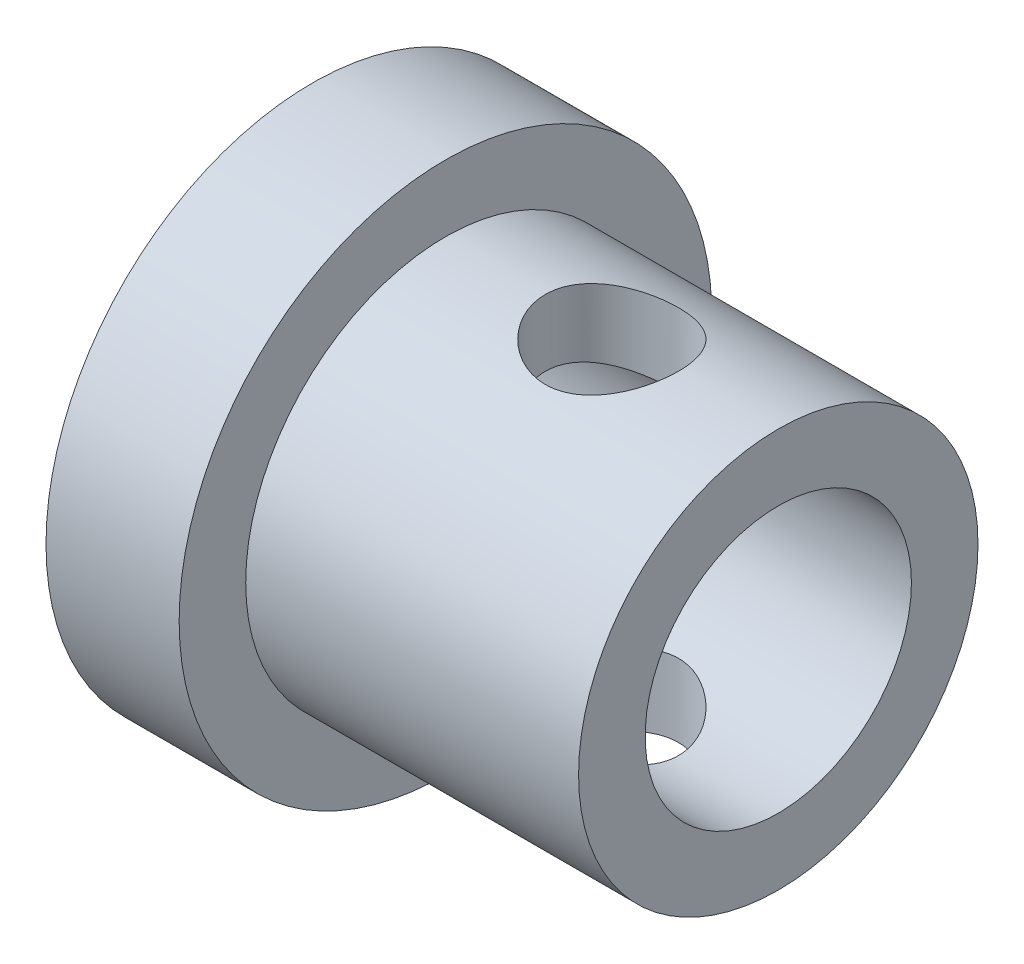
ISO-10303-21;
HEADER;
FILE_DESCRIPTION(('STEP AP214'),'2;1');
FILE_NAME('part.step','',(''),(''),'','','');
FILE_SCHEMA(('AUTOMOTIVE_DESIGN { 1 0 10303 214 1 1 1 1 }'));
ENDSEC;
DATA;
#1=APPLICATION_CONTEXT('core data for automotive mechanical design processes');
#2=APPLICATION_PROTOCOL_DEFINITION('international standard','automotive_design',2000,#1);
#3=PRODUCT_CONTEXT('',#1,'mechanical');
#4=PRODUCT('Part','Part','',(#3));
#5=PRODUCT_RELATED_PRODUCT_CATEGORY('part','',(#4));
#6=PRODUCT_DEFINITION_FORMATION('','',#4);
#7=PRODUCT_DEFINITION_CONTEXT('part definition',#1,'design');
#8=PRODUCT_DEFINITION('design','',#6,#7);
#9=PRODUCT_DEFINITION_SHAPE('','',#8);
#10=(LENGTH_UNIT() NAMED_UNIT(*) SI_UNIT(.MILLI.,.METRE.));
#11=(NAMED_UNIT(*) PLANE_ANGLE_UNIT() SI_UNIT($,.RADIAN.));
#12=(NAMED_UNIT(*) SI_UNIT($,.STERADIAN.) SOLID_ANGLE_UNIT());
#13=UNCERTAINTY_MEASURE_WITH_UNIT(LENGTH_MEASURE(1.E-05),#10,'distance_accuracy_value','');
#14=(GEOMETRIC_REPRESENTATION_CONTEXT(3) GLOBAL_UNCERTAINTY_ASSIGNED_CONTEXT((#13)) GLOBAL_UNIT_ASSIGNED_CONTEXT((#10,
#11,#12)) REPRESENTATION_CONTEXT('',''));
#15=CARTESIAN_POINT('',(0.,0.,0.));
#16=DIRECTION('',(0.,0.,1.));
#17=DIRECTION('',(1.,0.,0.));
#18=AXIS2_PLACEMENT_3D('',#15,#16,#17);
#19=CARTESIAN_POINT('',(3.5,0.,0.));
#20=DIRECTION('',(-1.,0.,0.));
#21=DIRECTION('',(0.,0.,1.));
#22=AXIS2_PLACEMENT_3D('',#19,#20,#21);
#23=CYLINDRICAL_SURFACE('',#22,3.);
#24=CARTESIAN_POINT('',(1.,-2.82842712474619,1.));
#25=CARTESIAN_POINT('',(1.05446817481068,-2.82842694532735,1.0000002579478));
#26=CARTESIAN_POINT('',(1.10893479977153,-2.83001769372806,0.99553478369814));
#27=CARTESIAN_POINT('',(1.21625442095062,-2.8361757417458,0.977851131702564));
#28=CARTESIAN_POINT('',(1.26910714986394,-2.8407435316722,0.964631512170673));
#29=CARTESIAN_POINT('',(1.37162689301281,-2.85228203663888,0.929955485680262));
#30=CARTESIAN_POINT('',(1.42129992944688,-2.8592480396464,0.908515221402));
#31=CARTESIAN_POINT('',(1.5163600485438,-2.87479122017008,0.858061628442627));
#32=CARTESIAN_POINT('',(1.5617461825525,-2.88336875305432,0.829046628860522));
#33=CARTESIAN_POINT('',(1.64871996233949,-2.90154489405589,0.763051146442527));
#34=CARTESIAN_POINT('',(1.69011542867204,-2.91116894844139,0.725824341377825));
#35=CARTESIAN_POINT('',(1.76620680122432,-2.93013864801508,0.644987667214489));
#36=CARTESIAN_POINT('',(1.80090163158228,-2.93948424829099,0.601376775052401));
#37=CARTESIAN_POINT('',(1.86347889732968,-2.95713866921658,0.507604507964983));
#38=CARTESIAN_POINT('',(1.89115997061798,-2.96541407701568,0.457301911224518));
#39=CARTESIAN_POINT('',(1.93759158512749,-2.97969586771021,0.352431222987481));
#40=CARTESIAN_POINT('',(1.9563445331769,-2.98570286203012,0.297864285687214));
#41=CARTESIAN_POINT('',(1.9837358546324,-2.99459075431897,0.188028817433492));
#42=CARTESIAN_POINT('',(1.99270344625701,-2.99757314777558,0.132850754852967));
#43=CARTESIAN_POINT('',(2.00131629336066,-3.00043608218249,0.0216978748240906));
#44=CARTESIAN_POINT('',(2.00096395165242,-3.00031742262891,-0.0342767335438934));
#45=CARTESIAN_POINT('',(1.99115574543397,-2.99706039618736,-0.143103515193818));
#46=CARTESIAN_POINT('',(1.98205747152549,-2.99404064755135,-0.195992048591668));
#47=CARTESIAN_POINT('',(1.95560701901955,-2.98546967339714,-0.299443438822161));
#48=CARTESIAN_POINT('',(1.93825428102024,-2.97991827631115,-0.350006137779176));
#49=CARTESIAN_POINT('',(1.89557868269387,-2.96675670293292,-0.448152474842014));
#50=CARTESIAN_POINT('',(1.87015406145322,-2.9591204252427,-0.495688220968999));
#51=CARTESIAN_POINT('',(1.81214029455161,-2.94258393038665,-0.58592432552717));
#52=CARTESIAN_POINT('',(1.77954915667336,-2.93368336200518,-0.62862333438477));
#53=CARTESIAN_POINT('',(1.70632560653926,-2.9150619185089,-0.710100866551907));
#54=CARTESIAN_POINT('',(1.66538684215456,-2.90532215172667,-0.748600157067556));
#55=CARTESIAN_POINT('',(1.57755127427734,-2.88647335245111,-0.81827725959589));
#56=CARTESIAN_POINT('',(1.53065355428676,-2.8773644173145,-0.849453943273005));
#57=CARTESIAN_POINT('',(1.43134637438458,-2.86070525135531,-0.903987455042732));
#58=CARTESIAN_POINT('',(1.37886786863219,-2.85317909338821,-0.927226463651049));
#59=CARTESIAN_POINT('',(1.27042860573374,-2.84081650878299,-0.964443193299507));
#60=CARTESIAN_POINT('',(1.21446931877818,-2.83597895501223,-0.978424795755529));
#61=CARTESIAN_POINT('',(1.10336164459938,-2.8297963630207,-0.996161282090474));
#62=CARTESIAN_POINT('',(1.04829057525428,-2.82830360315139,-1.00034909550575));
#63=CARTESIAN_POINT('',(0.938223850882962,-2.828566720628,-0.999605438911605));
#64=CARTESIAN_POINT('',(0.883228183975239,-2.83032200792768,-0.99467562522726));
#65=CARTESIAN_POINT('',(0.776843034288837,-2.83673618089379,-0.97622565155183));
#66=CARTESIAN_POINT('',(0.725394569849359,-2.84129325440593,-0.963006393980555));
#67=CARTESIAN_POINT('',(0.625456393760615,-2.8526855367127,-0.928713862560596));
#68=CARTESIAN_POINT('',(0.576967208409165,-2.85952114934907,-0.907639196363457));
#69=CARTESIAN_POINT('',(0.482619579153058,-2.87496877595718,-0.8574743407389));
#70=CARTESIAN_POINT('',(0.436893357358213,-2.8836302566561,-0.828151118358487));
#71=CARTESIAN_POINT('',(0.350853947616265,-2.90165768730984,-0.762585630557568));
#72=CARTESIAN_POINT('',(0.310542361338776,-2.911023844438,-0.726341325498784));
#73=CARTESIAN_POINT('',(0.234472015909365,-2.92995038637844,-0.645891705900322));
#74=CARTESIAN_POINT('',(0.199025609981151,-2.93949843577895,-0.601387270546651));
#75=CARTESIAN_POINT('',(0.136083857651955,-2.9572685161311,-0.506827291400257));
#76=CARTESIAN_POINT('',(0.108588228837575,-2.96549059417695,-0.456771944864552));
#77=CARTESIAN_POINT('',(0.062579895138285,-2.97964405810603,-0.352779862432295));
#78=CARTESIAN_POINT('',(0.0440087228519343,-2.98559030004531,-0.298871123321196));
#79=CARTESIAN_POINT('',(0.0162722579398949,-2.99458610837774,-0.188458465846016));
#80=CARTESIAN_POINT('',(0.00710357011949681,-2.99763672034018,-0.131955491953889));
#81=CARTESIAN_POINT('',(-0.00126207760564187,-3.00041863236257,-0.0208153358600406));
#82=CARTESIAN_POINT('',(-0.000907453932375802,-3.00029920089441,0.0337847239200191));
#83=CARTESIAN_POINT('',(0.00865730814640729,-2.99712196519396,0.142111145000174));
#84=CARTESIAN_POINT('',(0.0178667281527638,-2.99406439933567,0.195837576819055));
#85=CARTESIAN_POINT('',(0.0445822345759675,-2.98540914954421,0.300042119432061));
#86=CARTESIAN_POINT('',(0.0619542153529519,-2.9798525836118,0.350558270912795));
#87=CARTESIAN_POINT('',(0.104377531097136,-2.96677160704464,0.44797835093979));
#88=CARTESIAN_POINT('',(0.129430255196942,-2.95924684047901,0.49488162414241));
#89=CARTESIAN_POINT('',(0.187569512102081,-2.94265868828001,0.585634016308809));
#90=CARTESIAN_POINT('',(0.22091868538192,-2.93354872492381,0.629306251557697));
#91=CARTESIAN_POINT('',(0.294257391155915,-2.91492988791425,0.710581026272338));
#92=CARTESIAN_POINT('',(0.334249042261682,-2.90542088771397,0.748181621624259));
#93=CARTESIAN_POINT('',(0.421609355588035,-2.88663279827365,0.817741808833464));
#94=CARTESIAN_POINT('',(0.469205510980768,-2.87737727995345,0.849422965999216));
#95=CARTESIAN_POINT('',(0.569334426898652,-2.86060193316303,0.904314343299799));
#96=CARTESIAN_POINT('',(0.621865893014244,-2.8530816513617,0.927526776814559));
#97=CARTESIAN_POINT('',(0.727961824023833,-2.84101334230535,0.963843828206626));
#98=CARTESIAN_POINT('',(0.781372263565722,-2.83634632944799,0.977357909163268));
#99=CARTESIAN_POINT('',(0.889856050515475,-2.83005383613939,0.995434320161694));
#100=CARTESIAN_POINT('',(0.944928817435749,-2.82842730615135,0.999999739196502));
#101=CARTESIAN_POINT('',(1.,-2.82842712474619,1.));
#102=B_SPLINE_CURVE_WITH_KNOTS('',3,(#24,#25,#26,#27,#28,#29,#30,#31,#32,#33,#34,#35,#36,#37,
#38,#39,#40,#41,#42,#43,#44,#45,#46,#47,#48,#49,#50,#51,#52,#53,#54,#55,#56,#57,#58,#59,#60,#61,
#62,#63,#64,#65,#66,#67,#68,#69,#70,#71,#72,#73,#74,#75,#76,#77,#78,#79,#80,#81,#82,#83,#84,#85,
#86,#87,#88,#89,#90,#91,#92,#93,#94,#95,#96,#97,#98,#99,#100,#101),.UNSPECIFIED.,.T.,.F.,(4,2,2,
2,2,2,2,2,2,2,2,2,2,2,2,2,2,2,2,2,2,2,2,2,2,2,2,2,2,2,2,2,2,2,2,2,2,2,4),(0.,0.163200584775417,
0.32642805496888,0.489336627454544,0.652281166139159,0.821013374229398,0.989772651673597,
1.16293506139029,1.33605076382161,1.50314318760306,1.67019253297699,1.83069004820941,
1.99119844184608,2.15381654855707,2.31647991869394,2.48680174359289,2.65714979607478,
2.82992639837376,3.00263051349689,3.16754291357512,3.33242535830307,3.49164395761849,
3.65089079140019,3.81518857728788,3.979534856552,4.15178808164166,4.32403518750605,
4.49513791183924,4.66617882997229,4.82918084670708,4.99216964002854,5.15256956033503,
5.31299850756315,5.47935519513706,5.64576504425704,5.81868902729217,5.99156778259939,
6.15663212153686,6.32163947179229),.UNSPECIFIED.);
#103=CARTESIAN_POINT('',(1.,-2.82842712474619,1.));
#104=VERTEX_POINT('',#103);
#105=EDGE_CURVE('E76',#104,#104,#102,.T.);
#106=ORIENTED_EDGE('',*,*,#105,.T.);
#107=EDGE_LOOP('',(#106));
#108=FACE_BOUND('',#107,.T.);
#109=CARTESIAN_POINT('',(1.,2.82842712474619,1.));
#110=CARTESIAN_POINT('',(0.945531825189323,2.82842694532735,1.0000002579478));
#111=CARTESIAN_POINT('',(0.891065200228475,2.83001769372806,0.99553478369814));
#112=CARTESIAN_POINT('',(0.783745579049384,2.8361757417458,0.977851131702564));
#113=CARTESIAN_POINT('',(0.730892850136063,2.8407435316722,0.964631512170674));
#114=CARTESIAN_POINT('',(0.628373106987187,2.85228203663888,0.929955485680263));
#115=CARTESIAN_POINT('',(0.578700070553118,2.8592480396464,0.908515221402));
#116=CARTESIAN_POINT('',(0.483639951456205,2.87479122017008,0.858061628442627));
#117=CARTESIAN_POINT('',(0.438253817447503,2.88336875305432,0.829046628860523));
#118=CARTESIAN_POINT('',(0.351280037660512,2.90154489405589,0.763051146442527));
#119=CARTESIAN_POINT('',(0.309884571327957,2.91116894844139,0.725824341377825));
#120=CARTESIAN_POINT('',(0.233793198775676,2.93013864801508,0.644987667214489));
#121=CARTESIAN_POINT('',(0.199098368417716,2.93948424829099,0.601376775052402));
#122=CARTESIAN_POINT('',(0.136521102670319,2.95713866921658,0.507604507964984));
#123=CARTESIAN_POINT('',(0.108840029382019,2.96541407701568,0.457301911224518));
#124=CARTESIAN_POINT('',(0.0624084148725132,2.9796958677102,0.352431222987481));
#125=CARTESIAN_POINT('',(0.0436554668231001,2.98570286203012,0.297864285687214));
#126=CARTESIAN_POINT('',(0.0162641453676014,2.99459075431897,0.188028817433493));
#127=CARTESIAN_POINT('',(0.00729655374299271,2.99757314777558,0.132850754852967));
#128=CARTESIAN_POINT('',(-0.0013162933606595,3.00043608218249,0.0216978748240912));
#129=CARTESIAN_POINT('',(-0.000963951652417497,3.00031742262891,-0.0342767335438928));
#130=CARTESIAN_POINT('',(0.00884425456603261,2.99706039618736,-0.143103515193817));
#131=CARTESIAN_POINT('',(0.0179425284745069,2.99404064755135,-0.195992048591667));
#132=CARTESIAN_POINT('',(0.0443929809804537,2.98546967339714,-0.299443438822161));
#133=CARTESIAN_POINT('',(0.0617457189797547,2.97991827631115,-0.350006137779175));
#134=CARTESIAN_POINT('',(0.104421317306129,2.96675670293292,-0.448152474842013));
#135=CARTESIAN_POINT('',(0.129845938546777,2.9591204252427,-0.495688220968998));
#136=CARTESIAN_POINT('',(0.18785970544839,2.94258393038665,-0.585924325527169));
#137=CARTESIAN_POINT('',(0.220450843326638,2.93368336200518,-0.628623334384769));
#138=CARTESIAN_POINT('',(0.293674393460737,2.9150619185089,-0.710100866551907));
#139=CARTESIAN_POINT('',(0.334613157845441,2.90532215172667,-0.748600157067556));
#140=CARTESIAN_POINT('',(0.422448725722657,2.88647335245111,-0.81827725959589));
#141=CARTESIAN_POINT('',(0.469346445713238,2.8773644173145,-0.849453943273005));
#142=CARTESIAN_POINT('',(0.568653625615415,2.86070525135531,-0.903987455042732));
#143=CARTESIAN_POINT('',(0.621132131367812,2.85317909338821,-0.927226463651049));
#144=CARTESIAN_POINT('',(0.729571394266262,2.84081650878299,-0.964443193299507));
#145=CARTESIAN_POINT('',(0.785530681221824,2.83597895501223,-0.978424795755529));
#146=CARTESIAN_POINT('',(0.896638355400619,2.8297963630207,-0.996161282090474));
#147=CARTESIAN_POINT('',(0.951709424745724,2.82830360315139,-1.00034909550575));
#148=CARTESIAN_POINT('',(1.06177614911704,2.828566720628,-0.999605438911605));
#149=CARTESIAN_POINT('',(1.11677181602476,2.83032200792768,-0.99467562522726));
#150=CARTESIAN_POINT('',(1.22315696571116,2.83673618089379,-0.97622565155183));
#151=CARTESIAN_POINT('',(1.27460543015064,2.84129325440593,-0.963006393980555));
#152=CARTESIAN_POINT('',(1.37454360623938,2.8526855367127,-0.928713862560596));
#153=CARTESIAN_POINT('',(1.42303279159083,2.85952114934907,-0.907639196363457));
#154=CARTESIAN_POINT('',(1.51738042084694,2.87496877595718,-0.857474340738901));
#155=CARTESIAN_POINT('',(1.56310664264179,2.8836302566561,-0.828151118358487));
#156=CARTESIAN_POINT('',(1.64914605238373,2.90165768730984,-0.762585630557568));
#157=CARTESIAN_POINT('',(1.68945763866122,2.91102384443799,-0.726341325498785));
#158=CARTESIAN_POINT('',(1.76552798409063,2.92995038637844,-0.645891705900323));
#159=CARTESIAN_POINT('',(1.80097439001885,2.93949843577895,-0.601387270546652));
#160=CARTESIAN_POINT('',(1.86391614234804,2.9572685161311,-0.506827291400258));
#161=CARTESIAN_POINT('',(1.89141177116242,2.96549059417695,-0.456771944864553));
#162=CARTESIAN_POINT('',(1.93742010486171,2.97964405810603,-0.352779862432296));
#163=CARTESIAN_POINT('',(1.95599127714807,2.98559030004531,-0.298871123321197));
#164=CARTESIAN_POINT('',(1.9837277420601,2.99458610837774,-0.188458465846017));
#165=CARTESIAN_POINT('',(1.9928964298805,2.99763672034018,-0.13195549195389));
#166=CARTESIAN_POINT('',(2.00126207760564,3.00041863236257,-0.0208153358600409));
#167=CARTESIAN_POINT('',(2.00090745393238,3.00029920089441,0.0337847239200188));
#168=CARTESIAN_POINT('',(1.99134269185359,2.99712196519396,0.142111145000173));
#169=CARTESIAN_POINT('',(1.98213327184724,2.99406439933567,0.195837576819055));
#170=CARTESIAN_POINT('',(1.95541776542403,2.98540914954421,0.30004211943206));
#171=CARTESIAN_POINT('',(1.93804578464705,2.9798525836118,0.350558270912795));
#172=CARTESIAN_POINT('',(1.89562246890286,2.96677160704464,0.447978350939789));
#173=CARTESIAN_POINT('',(1.87056974480306,2.95924684047901,0.494881624142409));
#174=CARTESIAN_POINT('',(1.81243048789792,2.94265868828001,0.585634016308809));
#175=CARTESIAN_POINT('',(1.77908131461808,2.93354872492381,0.629306251557696));
#176=CARTESIAN_POINT('',(1.70574260884409,2.91492988791425,0.710581026272338));
#177=CARTESIAN_POINT('',(1.66575095773832,2.90542088771397,0.748181621624259));
#178=CARTESIAN_POINT('',(1.57839064441197,2.88663279827365,0.817741808833464));
#179=CARTESIAN_POINT('',(1.53079448901923,2.87737727995345,0.849422965999216));
#180=CARTESIAN_POINT('',(1.43066557310135,2.86060193316303,0.904314343299799));
#181=CARTESIAN_POINT('',(1.37813410698576,2.8530816513617,0.927526776814559));
#182=CARTESIAN_POINT('',(1.27203817597617,2.84101334230535,0.963843828206626));
#183=CARTESIAN_POINT('',(1.21862773643428,2.83634632944799,0.977357909163268));
#184=CARTESIAN_POINT('',(1.11014394948452,2.83005383613939,0.995434320161694));
#185=CARTESIAN_POINT('',(1.05507118256425,2.82842730615135,0.999999739196502));
#186=CARTESIAN_POINT('',(1.,2.82842712474619,1.));
#187=B_SPLINE_CURVE_WITH_KNOTS('',3,(#109,#110,#111,#112,#113,#114,#115,#116,#117,#118,#119,
#120,#121,#122,#123,#124,#125,#126,#127,#128,#129,#130,#131,#132,#133,#134,#135,#136,#137,#138,
#139,#140,#141,#142,#143,#144,#145,#146,#147,#148,#149,#150,#151,#152,#153,#154,#155,#156,#157,
#158,#159,#160,#161,#162,#163,#164,#165,#166,#167,#168,#169,#170,#171,#172,#173,#174,#175,#176,
#177,#178,#179,#180,#181,#182,#183,#184,#185,#186),.UNSPECIFIED.,.T.,.F.,(4,2,2,2,2,2,2,2,2,2,2,
2,2,2,2,2,2,2,2,2,2,2,2,2,2,2,2,2,2,2,2,2,2,2,2,2,2,2,4),(0.,0.163200584775417,0.32642805496888,
0.489336627454544,0.652281166139158,0.821013374229398,0.989772651673596,1.16293506139029,
1.33605076382161,1.50314318760306,1.67019253297699,1.83069004820941,1.99119844184608,
2.15381654855707,2.31647991869394,2.48680174359289,2.65714979607478,2.82992639837376,
3.00263051349688,3.16754291357512,3.33242535830307,3.49164395761849,3.65089079140019,
3.81518857728788,3.979534856552,4.15178808164165,4.32403518750605,4.49513791183924,
4.66617882997229,4.82918084670708,4.99216964002854,5.15256956033503,5.31299850756315,
5.47935519513707,5.64576504425704,5.81868902729217,5.9915677825994,6.15663212153686,
6.32163947179229),.UNSPECIFIED.);
#188=CARTESIAN_POINT('',(1.,2.82842712474619,1.));
#189=VERTEX_POINT('',#188);
#190=EDGE_CURVE('E71',#189,#189,#187,.T.);
#191=ORIENTED_EDGE('',*,*,#190,.T.);
#192=EDGE_LOOP('',(#191));
#193=FACE_BOUND('',#192,.T.);
#194=CARTESIAN_POINT('',(3.5,0.,0.));
#195=DIRECTION('',(1.,0.,0.));
#196=DIRECTION('',(0.,0.,-1.));
#197=AXIS2_PLACEMENT_3D('',#194,#195,#196);
#198=CIRCLE('',#197,3.);
#199=CARTESIAN_POINT('',(3.5,0.,-3.));
#200=VERTEX_POINT('',#199);
#201=EDGE_CURVE('E45',#200,#200,#198,.T.);
#202=ORIENTED_EDGE('',*,*,#201,.F.);
#203=EDGE_LOOP('',(#202));
#204=FACE_BOUND('',#203,.T.);
#205=CARTESIAN_POINT('',(-1.5,0.,0.));
#206=DIRECTION('',(-1.,0.,0.));
#207=DIRECTION('',(0.,0.,1.));
#208=AXIS2_PLACEMENT_3D('',#205,#206,#207);
#209=CIRCLE('',#208,3.);
#210=CARTESIAN_POINT('',(-1.5,0.,3.));
#211=VERTEX_POINT('',#210);
#212=EDGE_CURVE('E10',#211,#211,#209,.T.);
#213=ORIENTED_EDGE('',*,*,#212,.F.);
#214=EDGE_LOOP('',(#213));
#215=FACE_BOUND('',#214,.T.);
#216=ADVANCED_FACE('F32',(#108,#193,#204,#215),#23,.T.);
#217=CARTESIAN_POINT('',(3.5,0.,0.));
#218=DIRECTION('',(1.,0.,0.));
#219=DIRECTION('',(0.,0.,-1.));
#220=AXIS2_PLACEMENT_3D('',#217,#218,#219);
#221=PLANE('',#220);
#222=CARTESIAN_POINT('',(3.5,0.,0.));
#223=DIRECTION('',(1.,0.,0.));
#224=DIRECTION('',(0.,0.,-1.));
#225=AXIS2_PLACEMENT_3D('',#222,#223,#224);
#226=CIRCLE('',#225,2.);
#227=CARTESIAN_POINT('',(3.5,0.,-2.));
#228=VERTEX_POINT('',#227);
#229=EDGE_CURVE('E82',#228,#228,#226,.T.);
#230=ORIENTED_EDGE('',*,*,#229,.F.);
#231=EDGE_LOOP('',(#230));
#232=FACE_BOUND('',#231,.T.);
#233=ORIENTED_EDGE('',*,*,#201,.T.);
#234=EDGE_LOOP('',(#233));
#235=FACE_BOUND('',#234,.T.);
#236=ADVANCED_FACE('F98',(#232,#235),#221,.T.);
#237=CARTESIAN_POINT('',(-1.5,0.,0.));
#238=DIRECTION('',(-1.,0.,0.));
#239=DIRECTION('',(0.,0.,1.));
#240=AXIS2_PLACEMENT_3D('',#237,#238,#239);
#241=CYLINDRICAL_SURFACE('',#240,4.);
#242=CARTESIAN_POINT('',(-1.5,0.,0.));
#243=DIRECTION('',(-1.,0.,0.));
#244=DIRECTION('',(0.,0.,1.));
#245=AXIS2_PLACEMENT_3D('',#242,#243,#244);
#246=CIRCLE('',#245,4.);
#247=CARTESIAN_POINT('',(-1.5,0.,4.));
#248=VERTEX_POINT('',#247);
#249=EDGE_CURVE('E50',#248,#248,#246,.T.);
#250=ORIENTED_EDGE('',*,*,#249,.T.);
#251=EDGE_LOOP('',(#250));
#252=FACE_BOUND('',#251,.T.);
#253=CARTESIAN_POINT('',(-3.5,0.,0.));
#254=DIRECTION('',(-1.,0.,0.));
#255=DIRECTION('',(0.,0.,1.));
#256=AXIS2_PLACEMENT_3D('',#253,#254,#255);
#257=CIRCLE('',#256,4.);
#258=CARTESIAN_POINT('',(-3.5,0.,4.));
#259=VERTEX_POINT('',#258);
#260=EDGE_CURVE('E86',#259,#259,#257,.T.);
#261=ORIENTED_EDGE('',*,*,#260,.F.);
#262=EDGE_LOOP('',(#261));
#263=FACE_BOUND('',#262,.T.);
#264=ADVANCED_FACE('F95',(#252,#263),#241,.T.);
#265=CARTESIAN_POINT('',(-1.5,0.,0.));
#266=DIRECTION('',(-1.,0.,0.));
#267=DIRECTION('',(0.,0.,1.));
#268=AXIS2_PLACEMENT_3D('',#265,#266,#267);
#269=PLANE('',#268);
#270=ORIENTED_EDGE('',*,*,#212,.T.);
#271=EDGE_LOOP('',(#270));
#272=FACE_BOUND('',#271,.T.);
#273=ORIENTED_EDGE('',*,*,#249,.F.);
#274=EDGE_LOOP('',(#273));
#275=FACE_BOUND('',#274,.T.);
#276=ADVANCED_FACE('F97',(#272,#275),#269,.F.);
#277=CARTESIAN_POINT('',(-3.5,0.,0.));
#278=DIRECTION('',(1.,0.,0.));
#279=DIRECTION('',(0.,0.,-1.));
#280=AXIS2_PLACEMENT_3D('',#277,#278,#279);
#281=PLANE('',#280);
#282=CARTESIAN_POINT('',(-3.5,0.,0.));
#283=DIRECTION('',(1.,0.,0.));
#284=DIRECTION('',(0.,0.,-1.));
#285=AXIS2_PLACEMENT_3D('',#282,#283,#284);
#286=CIRCLE('',#285,2.);
#287=CARTESIAN_POINT('',(-3.5,0.,-2.));
#288=VERTEX_POINT('',#287);
#289=EDGE_CURVE('E83',#288,#288,#286,.T.);
#290=ORIENTED_EDGE('',*,*,#289,.T.);
#291=EDGE_LOOP('',(#290));
#292=FACE_BOUND('',#291,.T.);
#293=ORIENTED_EDGE('',*,*,#260,.T.);
#294=EDGE_LOOP('',(#293));
#295=FACE_BOUND('',#294,.T.);
#296=ADVANCED_FACE('F93',(#292,#295),#281,.F.);
#297=CARTESIAN_POINT('',(-3.5,0.,0.));
#298=DIRECTION('',(1.,0.,0.));
#299=DIRECTION('',(0.,0.,-1.));
#300=AXIS2_PLACEMENT_3D('',#297,#298,#299);
#301=CYLINDRICAL_SURFACE('',#300,2.);
#302=CARTESIAN_POINT('',(1.,-1.73205080756888,1.));
#303=CARTESIAN_POINT('',(0.94789219180475,-1.73205534728459,0.999996363074532));
#304=CARTESIAN_POINT('',(0.895718588474954,-1.73443801187756,0.995899970733217));
#305=CARTESIAN_POINT('',(0.792972735322847,-1.74362366452052,0.979723209898053));
#306=CARTESIAN_POINT('',(0.742404084956592,-1.75043594055559,0.967626064554179));
#307=CARTESIAN_POINT('',(0.644548335656059,-1.76749346605398,0.936099948699812));
#308=CARTESIAN_POINT('',(0.597245347526413,-1.77772043473252,0.916709952493731));
#309=CARTESIAN_POINT('',(0.50657579800328,-1.80042664816858,0.871267525376372));
#310=CARTESIAN_POINT('',(0.463209449737542,-1.81290601476065,0.845214734035773));
#311=CARTESIAN_POINT('',(0.377694271442494,-1.83996869057441,0.784666540530879));
#312=CARTESIAN_POINT('',(0.335940864326456,-1.85464063637954,0.74965203614377));
#313=CARTESIAN_POINT('',(0.25859161159329,-1.88371982785706,0.673253807614468));
#314=CARTESIAN_POINT('',(0.222998837416479,-1.8981269383125,0.631866925782293));
#315=CARTESIAN_POINT('',(0.156632848852337,-1.92621476952949,0.540489563414546));
#316=CARTESIAN_POINT('',(0.12634623214047,-1.93978106418172,0.490107189012575));
#317=CARTESIAN_POINT('',(0.0748591467542373,-1.96350756099529,0.384157026599504));
#318=CARTESIAN_POINT('',(0.0536529438628296,-1.97366991183742,0.328592538138155));
#319=CARTESIAN_POINT('',(0.0224953386989024,-1.98880461244237,0.218044943925977));
#320=CARTESIAN_POINT('',(0.0118504736444666,-1.99409480220892,0.163301790488817));
#321=CARTESIAN_POINT('',(-0.000166118675038273,-2.00007583846067,0.0525706286978478));
#322=CARTESIAN_POINT('',(-0.00154345679571052,-2.0007694678459,-0.0034166058437388));
#323=CARTESIAN_POINT('',(0.0047466739703493,-1.9976298191645,-0.10983252442375));
#324=CARTESIAN_POINT('',(0.0116380155212225,-1.9941849589216,-0.160321199176792));
#325=CARTESIAN_POINT('',(0.0328808439046571,-1.98374245259747,-0.259313771918322));
#326=CARTESIAN_POINT('',(0.0472328889762229,-1.97674454066394,-0.307817521093926));
#327=CARTESIAN_POINT('',(0.0830825660898132,-1.95971583287654,-0.402309391569554));
#328=CARTESIAN_POINT('',(0.104676313172067,-1.94964441529199,-0.448253423515179));
#329=CARTESIAN_POINT('',(0.154263416201493,-1.92737645986687,-0.535976801513329));
#330=CARTESIAN_POINT('',(0.18225906330235,-1.91517916157484,-0.577754648838646));
#331=CARTESIAN_POINT('',(0.246895351533015,-1.88844394399229,-0.660173660898195));
#332=CARTESIAN_POINT('',(0.28410302832601,-1.87379375998175,-0.700334075029361));
#333=CARTESIAN_POINT('',(0.364589724930177,-1.84454340586812,-0.77410437029778));
#334=CARTESIAN_POINT('',(0.407873372274063,-1.82994328265629,-0.807709211574231));
#335=CARTESIAN_POINT('',(0.502648192424087,-1.80144156092485,-0.869505334642212));
#336=CARTESIAN_POINT('',(0.554486023054211,-1.78764319990708,-0.897217314978052));
#337=CARTESIAN_POINT('',(0.662937671358998,-1.76375450278576,-0.943319113001232));
#338=CARTESIAN_POINT('',(0.719546433017562,-1.75366030046067,-0.96171865821089));
#339=CARTESIAN_POINT('',(0.831214511282791,-1.73944635817034,-0.987180211025041));
#340=CARTESIAN_POINT('',(0.886041119043552,-1.73491655848496,-0.995025122119976));
#341=CARTESIAN_POINT('',(0.996401341516542,-1.7311791936161,-1.00151694661143));
#342=CARTESIAN_POINT('',(1.05193442911979,-1.73196786889312,-1.00017035731503));
#343=CARTESIAN_POINT('',(1.15565391857873,-1.73834336540585,-0.989036043343966));
#344=CARTESIAN_POINT('',(1.20397945110793,-1.74339587506654,-0.980187816712467));
#345=CARTESIAN_POINT('',(1.29836778627096,-1.75694021551341,-0.955696284632441));
#346=CARTESIAN_POINT('',(1.34442985074661,-1.76543316005034,-0.940050778623614));
#347=CARTESIAN_POINT('',(1.4354113309027,-1.78536222079657,-0.901647588604886));
#348=CARTESIAN_POINT('',(1.48017901685355,-1.79691643243063,-0.878594063692723));
#349=CARTESIAN_POINT('',(1.56546927153899,-1.8215611949725,-0.826287064015804));
#350=CARTESIAN_POINT('',(1.60598964351328,-1.83465253355148,-0.797030404332216));
#351=CARTESIAN_POINT('',(1.68697876752355,-1.86287998456336,-0.728837167198853));
#352=CARTESIAN_POINT('',(1.72679715071766,-1.87806583154289,-0.689145272314967));
#353=CARTESIAN_POINT('',(1.79941223799359,-1.90734234977893,-0.603404495398289));
#354=CARTESIAN_POINT('',(1.83220657023054,-1.92143265007709,-0.557353474655347));
#355=CARTESIAN_POINT('',(1.8905737259501,-1.94741361690957,-0.458535362558757));
#356=CARTESIAN_POINT('',(1.91593311821091,-1.95923641672029,-0.405623097574113));
#357=CARTESIAN_POINT('',(1.95713790385739,-1.97883354959301,-0.295522364641082));
#358=CARTESIAN_POINT('',(1.97299165136631,-1.98661143676373,-0.238337701392176));
#359=CARTESIAN_POINT('',(1.99336856417466,-1.99667508181883,-0.126979682330417));
#360=CARTESIAN_POINT('',(1.99879787587611,-1.99939927908191,-0.0730114438504569));
#361=CARTESIAN_POINT('',(2.0008432654544,-2.00042130375131,0.0351259859512038));
#362=CARTESIAN_POINT('',(1.99746242852356,-1.9987206806689,0.089295100295087));
#363=CARTESIAN_POINT('',(1.98258359320438,-1.99133968837923,0.192537992317147));
#364=CARTESIAN_POINT('',(1.97163515074233,-1.9859289466799,0.241712317811264));
#365=CARTESIAN_POINT('',(1.94267300069703,-1.97192093663423,0.337445952183618));
#366=CARTESIAN_POINT('',(1.92465827990655,-1.96332321132796,0.384004884955509));
#367=CARTESIAN_POINT('',(1.88127294783403,-1.9432593074812,0.475423406244885));
#368=CARTESIAN_POINT('',(1.85562067679216,-1.93168617198799,0.520125142700047));
#369=CARTESIAN_POINT('',(1.79804206914095,-1.90688133141826,0.604774641814025));
#370=CARTESIAN_POINT('',(1.76611285088433,-1.89364886558361,0.644720207414908));
#371=CARTESIAN_POINT('',(1.6932028609773,-1.86528610226628,0.722914004156892));
#372=CARTESIAN_POINT('',(1.65163751252281,-1.85009799011698,0.760597684539272));
#373=CARTESIAN_POINT('',(1.56254927887023,-1.82063076162852,0.828663287394675));
#374=CARTESIAN_POINT('',(1.51502117913232,-1.80635245761865,0.859038750010059));
#375=CARTESIAN_POINT('',(1.41336335341904,-1.77999605304916,0.912431079785655));
#376=CARTESIAN_POINT('',(1.35907246887126,-1.7680017425627,0.93518506596094));
#377=CARTESIAN_POINT('',(1.24666759566022,-1.74866156328351,0.970878709506412));
#378=CARTESIAN_POINT('',(1.18856711108731,-1.74130016147702,0.983851191175347));
#379=CARTESIAN_POINT('',(1.108194644348,-1.7352927260179,0.994367007864415));
#380=CARTESIAN_POINT('',(1.08663210560212,-1.73408129005152,0.996476104963851));
#381=CARTESIAN_POINT('',(1.04338351931776,-1.7324593588775,0.999293405089963));
#382=CARTESIAN_POINT('',(1.02169746361413,-1.73204891725109,1.00000151439987));
#383=CARTESIAN_POINT('',(1.,-1.73205080756888,1.));
#384=B_SPLINE_CURVE_WITH_KNOTS('',3,(#302,#303,#304,#305,#306,#307,#308,#309,#310,#311,#312,
#313,#314,#315,#316,#317,#318,#319,#320,#321,#322,#323,#324,#325,#326,#327,#328,#329,#330,#331,
#332,#333,#334,#335,#336,#337,#338,#339,#340,#341,#342,#343,#344,#345,#346,#347,#348,#349,#350,
#351,#352,#353,#354,#355,#356,#357,#358,#359,#360,#361,#362,#363,#364,#365,#366,#367,#368,#369,
#370,#371,#372,#373,#374,#375,#376,#377,#378,#379,#380,#381,#382,#383),.UNSPECIFIED.,.T.,.F.,(4,
2,2,2,2,2,2,2,2,2,2,2,2,2,2,2,2,2,2,2,2,2,2,2,2,2,2,2,2,2,2,2,2,2,2,2,2,2,2,2,4),(0.,
0.156232122594716,0.312792892824805,0.468528595918886,0.62427272544515,0.792862312498234,
0.96153571084371,1.14157892238764,1.32150826963891,1.48863484967935,1.6556602368604,
1.80816097484538,1.96067312517455,2.11529534731147,2.26997299350272,2.43927191456891,
2.60870048245919,2.78888841729448,2.96888774211705,3.13462290854212,3.30024093188373,
3.44774183424026,3.59529052436063,3.74967296406088,3.90413486220047,4.07806743580613,
4.25205864978202,4.43064181412966,4.60906779808772,4.77112270389487,4.93312086793972,
5.08444424871492,5.23578933512013,5.39360750719472,5.55149830100719,5.72510241850068,
5.89885942845154,6.07810749038605,6.2567513300276,6.32180135185309,6.38685572494541),.UNSPECIFIED.);
#385=CARTESIAN_POINT('',(1.,-1.73205080756888,1.));
#386=VERTEX_POINT('',#385);
#387=EDGE_CURVE('E36',#386,#386,#384,.T.);
#388=ORIENTED_EDGE('',*,*,#387,.T.);
#389=EDGE_LOOP('',(#388));
#390=FACE_BOUND('',#389,.T.);
#391=CARTESIAN_POINT('',(1.,1.73205080756888,1.));
#392=CARTESIAN_POINT('',(1.05210780819525,1.73205534728459,0.999996363074532));
#393=CARTESIAN_POINT('',(1.10428141152505,1.73443801187756,0.995899970733217));
#394=CARTESIAN_POINT('',(1.20702726467715,1.74362366452052,0.979723209898053));
#395=CARTESIAN_POINT('',(1.25759591504341,1.75043594055559,0.967626064554179));
#396=CARTESIAN_POINT('',(1.35545166434394,1.76749346605398,0.936099948699812));
#397=CARTESIAN_POINT('',(1.40275465247359,1.77772043473252,0.916709952493731));
#398=CARTESIAN_POINT('',(1.49342420199672,1.80042664816858,0.871267525376372));
#399=CARTESIAN_POINT('',(1.53679055026246,1.81290601476065,0.845214734035773));
#400=CARTESIAN_POINT('',(1.62230572855751,1.83996869057441,0.784666540530879));
#401=CARTESIAN_POINT('',(1.66405913567354,1.85464063637954,0.74965203614377));
#402=CARTESIAN_POINT('',(1.74140838840671,1.88371982785706,0.673253807614468));
#403=CARTESIAN_POINT('',(1.77700116258352,1.8981269383125,0.631866925782293));
#404=CARTESIAN_POINT('',(1.84336715114766,1.92621476952949,0.540489563414546));
#405=CARTESIAN_POINT('',(1.87365376785953,1.93978106418172,0.490107189012575));
#406=CARTESIAN_POINT('',(1.92514085324576,1.96350756099529,0.384157026599504));
#407=CARTESIAN_POINT('',(1.94634705613717,1.97366991183742,0.328592538138155));
#408=CARTESIAN_POINT('',(1.9775046613011,1.98880461244237,0.218044943925977));
#409=CARTESIAN_POINT('',(1.98814952635553,1.99409480220892,0.163301790488817));
#410=CARTESIAN_POINT('',(2.00016611867504,2.00007583846067,0.0525706286978479));
#411=CARTESIAN_POINT('',(2.00154345679571,2.0007694678459,-0.00341660584373873));
#412=CARTESIAN_POINT('',(1.99525332602965,1.9976298191645,-0.10983252442375));
#413=CARTESIAN_POINT('',(1.98836198447878,1.9941849589216,-0.160321199176792));
#414=CARTESIAN_POINT('',(1.96711915609534,1.98374245259747,-0.259313771918322));
#415=CARTESIAN_POINT('',(1.95276711102378,1.97674454066394,-0.307817521093926));
#416=CARTESIAN_POINT('',(1.91691743391019,1.95971583287654,-0.402309391569554));
#417=CARTESIAN_POINT('',(1.89532368682793,1.94964441529199,-0.448253423515179));
#418=CARTESIAN_POINT('',(1.84573658379851,1.92737645986687,-0.535976801513329));
#419=CARTESIAN_POINT('',(1.81774093669765,1.91517916157484,-0.577754648838646));
#420=CARTESIAN_POINT('',(1.75310464846698,1.88844394399229,-0.660173660898195));
#421=CARTESIAN_POINT('',(1.71589697167399,1.87379375998175,-0.700334075029361));
#422=CARTESIAN_POINT('',(1.63541027506982,1.84454340586812,-0.774104370297781));
#423=CARTESIAN_POINT('',(1.59212662772594,1.82994328265629,-0.807709211574231));
#424=CARTESIAN_POINT('',(1.49735180757591,1.80144156092485,-0.869505334642212));
#425=CARTESIAN_POINT('',(1.44551397694579,1.78764319990707,-0.897217314978052));
#426=CARTESIAN_POINT('',(1.337062328641,1.76375450278576,-0.943319113001232));
#427=CARTESIAN_POINT('',(1.28045356698244,1.75366030046067,-0.96171865821089));
#428=CARTESIAN_POINT('',(1.16878548871721,1.73944635817034,-0.987180211025041));
#429=CARTESIAN_POINT('',(1.11395888095645,1.73491655848496,-0.995025122119976));
#430=CARTESIAN_POINT('',(1.00359865848346,1.73117919361609,-1.00151694661143));
#431=CARTESIAN_POINT('',(0.948065570880213,1.73196786889312,-1.00017035731503));
#432=CARTESIAN_POINT('',(0.844346081421271,1.73834336540585,-0.989036043343966));
#433=CARTESIAN_POINT('',(0.796020548892072,1.74339587506654,-0.980187816712467));
#434=CARTESIAN_POINT('',(0.701632213729041,1.75694021551341,-0.955696284632441));
#435=CARTESIAN_POINT('',(0.655570149253392,1.76543316005034,-0.940050778623615));
#436=CARTESIAN_POINT('',(0.564588669097304,1.78536222079657,-0.901647588604886));
#437=CARTESIAN_POINT('',(0.519820983146448,1.79691643243063,-0.878594063692723));
#438=CARTESIAN_POINT('',(0.434530728461006,1.8215611949725,-0.826287064015805));
#439=CARTESIAN_POINT('',(0.394010356486717,1.83465253355148,-0.797030404332217));
#440=CARTESIAN_POINT('',(0.313021232476452,1.86287998456336,-0.728837167198854));
#441=CARTESIAN_POINT('',(0.273202849282341,1.87806583154289,-0.689145272314967));
#442=CARTESIAN_POINT('',(0.200587762006409,1.90734234977892,-0.603404495398289));
#443=CARTESIAN_POINT('',(0.16779342976946,1.92143265007709,-0.557353474655347));
#444=CARTESIAN_POINT('',(0.109426274049898,1.94741361690957,-0.458535362558758));
#445=CARTESIAN_POINT('',(0.0840668817890901,1.95923641672029,-0.405623097574113));
#446=CARTESIAN_POINT('',(0.0428620961426073,1.97883354959301,-0.295522364641082));
#447=CARTESIAN_POINT('',(0.027008348633695,1.98661143676373,-0.238337701392176));
#448=CARTESIAN_POINT('',(0.00663143582533808,1.99667508181883,-0.126979682330417));
#449=CARTESIAN_POINT('',(0.00120212412388615,1.99939927908191,-0.0730114438504573));
#450=CARTESIAN_POINT('',(-0.000843265454401555,2.00042130375131,0.0351259859512033));
#451=CARTESIAN_POINT('',(0.00253757147643598,1.9987206806689,0.0892951002950865));
#452=CARTESIAN_POINT('',(0.017416406795624,1.99133968837923,0.192537992317147));
#453=CARTESIAN_POINT('',(0.028364849257671,1.9859289466799,0.241712317811263));
#454=CARTESIAN_POINT('',(0.0573269993029705,1.97192093663423,0.337445952183617));
#455=CARTESIAN_POINT('',(0.0753417200934524,1.96332321132796,0.384004884955508));
#456=CARTESIAN_POINT('',(0.118727052165973,1.9432593074812,0.475423406244885));
#457=CARTESIAN_POINT('',(0.144379323207839,1.93168617198799,0.520125142700046));
#458=CARTESIAN_POINT('',(0.20195793085905,1.90688133141826,0.604774641814025));
#459=CARTESIAN_POINT('',(0.233887149115673,1.89364886558361,0.644720207414907));
#460=CARTESIAN_POINT('',(0.306797139022702,1.86528610226628,0.722914004156891));
#461=CARTESIAN_POINT('',(0.348362487477192,1.85009799011698,0.760597684539272));
#462=CARTESIAN_POINT('',(0.43745072112977,1.82063076162852,0.828663287394675));
#463=CARTESIAN_POINT('',(0.484978820867684,1.80635245761865,0.859038750010059));
#464=CARTESIAN_POINT('',(0.586636646580955,1.77999605304916,0.912431079785654));
#465=CARTESIAN_POINT('',(0.640927531128736,1.7680017425627,0.935185065960939));
#466=CARTESIAN_POINT('',(0.753332404339778,1.74866156328352,0.970878709506412));
#467=CARTESIAN_POINT('',(0.811432888912686,1.74130016147702,0.983851191175347));
#468=CARTESIAN_POINT('',(0.891805355651996,1.7352927260179,0.994367007864415));
#469=CARTESIAN_POINT('',(0.913367894397883,1.73408129005152,0.996476104963851));
#470=CARTESIAN_POINT('',(0.956616480682243,1.7324593588775,0.999293405089963));
#471=CARTESIAN_POINT('',(0.978302536385874,1.73204891725109,1.00000151439987));
#472=CARTESIAN_POINT('',(1.,1.73205080756888,1.));
#473=B_SPLINE_CURVE_WITH_KNOTS('',3,(#391,#392,#393,#394,#395,#396,#397,#398,#399,#400,#401,
#402,#403,#404,#405,#406,#407,#408,#409,#410,#411,#412,#413,#414,#415,#416,#417,#418,#419,#420,
#421,#422,#423,#424,#425,#426,#427,#428,#429,#430,#431,#432,#433,#434,#435,#436,#437,#438,#439,
#440,#441,#442,#443,#444,#445,#446,#447,#448,#449,#450,#451,#452,#453,#454,#455,#456,#457,#458,
#459,#460,#461,#462,#463,#464,#465,#466,#467,#468,#469,#470,#471,#472),.UNSPECIFIED.,.T.,.F.,(4,
2,2,2,2,2,2,2,2,2,2,2,2,2,2,2,2,2,2,2,2,2,2,2,2,2,2,2,2,2,2,2,2,2,2,2,2,2,2,2,4),(0.,
0.156232122594716,0.312792892824805,0.468528595918886,0.62427272544515,0.792862312498234,
0.96153571084371,1.14157892238763,1.32150826963891,1.48863484967935,1.6556602368604,
1.80816097484538,1.96067312517455,2.11529534731147,2.26997299350272,2.43927191456891,
2.60870048245919,2.78888841729448,2.96888774211705,3.13462290854212,3.30024093188373,
3.44774183424026,3.59529052436063,3.74967296406088,3.90413486220047,4.07806743580613,
4.25205864978202,4.43064181412966,4.60906779808772,4.77112270389487,4.93312086793972,
5.08444424871493,5.23578933512013,5.39360750719472,5.55149830100719,5.72510241850068,
5.89885942845155,6.07810749038605,6.25675133002761,6.3218013518531,6.38685572494541),.UNSPECIFIED.);
#474=CARTESIAN_POINT('',(1.,1.73205080756888,1.));
#475=VERTEX_POINT('',#474);
#476=EDGE_CURVE('E53',#475,#475,#473,.T.);
#477=ORIENTED_EDGE('',*,*,#476,.T.);
#478=EDGE_LOOP('',(#477));
#479=FACE_BOUND('',#478,.T.);
#480=ORIENTED_EDGE('',*,*,#289,.F.);
#481=EDGE_LOOP('',(#480));
#482=FACE_BOUND('',#481,.T.);
#483=ORIENTED_EDGE('',*,*,#229,.T.);
#484=EDGE_LOOP('',(#483));
#485=FACE_BOUND('',#484,.T.);
#486=ADVANCED_FACE('F58',(#390,#479,#482,#485),#301,.F.);
#487=CARTESIAN_POINT('',(1.,-4.,0.));
#488=DIRECTION('',(0.,1.,0.));
#489=DIRECTION('',(0.,0.,1.));
#490=AXIS2_PLACEMENT_3D('',#487,#488,#489);
#491=CYLINDRICAL_SURFACE('',#490,1.);
#492=ORIENTED_EDGE('',*,*,#476,.F.);
#493=EDGE_LOOP('',(#492));
#494=FACE_BOUND('',#493,.T.);
#495=ORIENTED_EDGE('',*,*,#190,.F.);
#496=EDGE_LOOP('',(#495));
#497=FACE_BOUND('',#496,.T.);
#498=ADVANCED_FACE('F64',(#494,#497),#491,.F.);
#499=ORIENTED_EDGE('',*,*,#387,.F.);
#500=EDGE_LOOP('',(#499));
#501=FACE_BOUND('',#500,.T.);
#502=ORIENTED_EDGE('',*,*,#105,.F.);
#503=EDGE_LOOP('',(#502));
#504=FACE_BOUND('',#503,.T.);
#505=ADVANCED_FACE('F61',(#501,#504),#491,.F.);
#506=CLOSED_SHELL('',(#216,#236,#264,#276,#296,#486,#498,#505));
#507=MANIFOLD_SOLID_BREP('B2',#506);
#508=ADVANCED_BREP_SHAPE_REPRESENTATION('',(#18,#507),#14);
#509=SHAPE_DEFINITION_REPRESENTATION(#9,#508);
ENDSEC;
END-ISO-10303-21;
